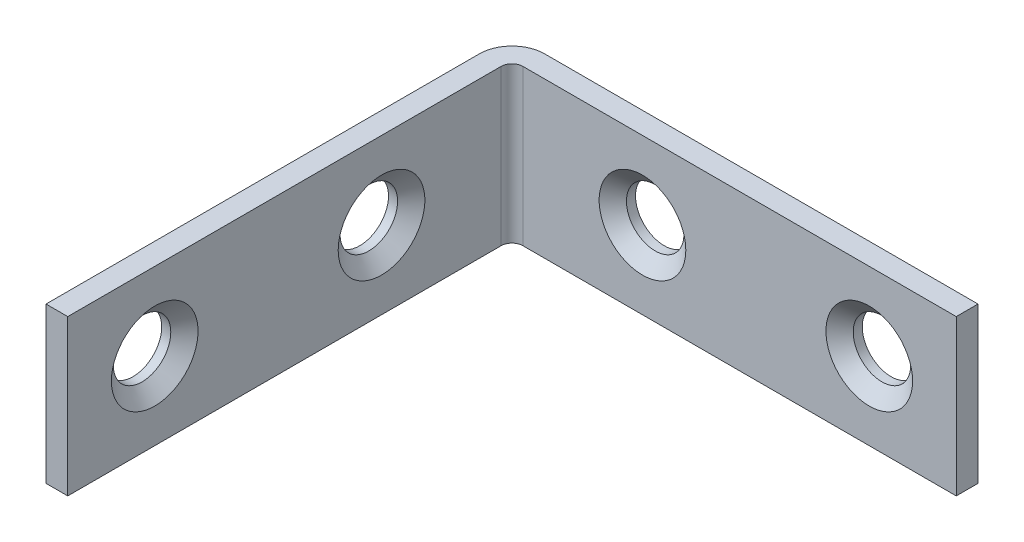
ISO-10303-21;
HEADER;
FILE_DESCRIPTION(('STEP AP214'),'2;1');
FILE_NAME('part.step','',(''),(''),'','','');
FILE_SCHEMA(('AUTOMOTIVE_DESIGN { 1 0 10303 214 1 1 1 1 }'));
ENDSEC;
DATA;
#1=APPLICATION_CONTEXT('core data for automotive mechanical design processes');
#2=APPLICATION_PROTOCOL_DEFINITION('international standard','automotive_design',2000,#1);
#3=PRODUCT_CONTEXT('',#1,'mechanical');
#4=PRODUCT('Part','Part','',(#3));
#5=PRODUCT_RELATED_PRODUCT_CATEGORY('part','',(#4));
#6=PRODUCT_DEFINITION_FORMATION('','',#4);
#7=PRODUCT_DEFINITION_CONTEXT('part definition',#1,'design');
#8=PRODUCT_DEFINITION('design','',#6,#7);
#9=PRODUCT_DEFINITION_SHAPE('','',#8);
#10=(LENGTH_UNIT() NAMED_UNIT(*) SI_UNIT(.MILLI.,.METRE.));
#11=(NAMED_UNIT(*) PLANE_ANGLE_UNIT() SI_UNIT($,.RADIAN.));
#12=(NAMED_UNIT(*) SI_UNIT($,.STERADIAN.) SOLID_ANGLE_UNIT());
#13=UNCERTAINTY_MEASURE_WITH_UNIT(LENGTH_MEASURE(1.E-05),#10,'distance_accuracy_value','');
#14=(GEOMETRIC_REPRESENTATION_CONTEXT(3) GLOBAL_UNCERTAINTY_ASSIGNED_CONTEXT((#13)) GLOBAL_UNIT_ASSIGNED_CONTEXT((#10,
#11,#12)) REPRESENTATION_CONTEXT('',''));
#15=CARTESIAN_POINT('',(0.,0.,0.));
#16=DIRECTION('',(0.,0.,1.));
#17=DIRECTION('',(1.,0.,0.));
#18=AXIS2_PLACEMENT_3D('',#15,#16,#17);
#19=CARTESIAN_POINT('',(2.667,6.35,1.778));
#20=DIRECTION('',(0.,0.,-1.));
#21=DIRECTION('',(-1.,0.,0.));
#22=AXIS2_PLACEMENT_3D('',#19,#20,#21);
#23=PLANE('',#22);
#24=CARTESIAN_POINT('',(12.446,0.,1.778));
#25=DIRECTION('',(0.,0.,1.));
#26=DIRECTION('',(1.,0.,0.));
#27=AXIS2_PLACEMENT_3D('',#24,#25,#26);
#28=CIRCLE('',#27,3.5433);
#29=CARTESIAN_POINT('',(15.9893,0.,1.778));
#30=VERTEX_POINT('',#29);
#31=EDGE_CURVE('E303',#30,#30,#28,.T.);
#32=ORIENTED_EDGE('',*,*,#31,.F.);
#33=EDGE_LOOP('',(#32));
#34=FACE_BOUND('',#33,.T.);
#35=CARTESIAN_POINT('',(30.988,0.,1.778));
#36=DIRECTION('',(0.,0.,1.));
#37=DIRECTION('',(1.,0.,0.));
#38=AXIS2_PLACEMENT_3D('',#35,#36,#37);
#39=CIRCLE('',#38,3.5433);
#40=CARTESIAN_POINT('',(34.5313,0.,1.778));
#41=VERTEX_POINT('',#40);
#42=EDGE_CURVE('E300',#41,#41,#39,.T.);
#43=ORIENTED_EDGE('',*,*,#42,.F.);
#44=EDGE_LOOP('',(#43));
#45=FACE_BOUND('',#44,.T.);
#46=DIRECTION('',(1.,0.,0.));
#47=VECTOR('',#46,1.);
#48=CARTESIAN_POINT('',(2.667,-6.35,1.778));
#49=LINE('',#48,#47);
#50=CARTESIAN_POINT('',(2.667,-6.35,1.778));
#51=VERTEX_POINT('',#50);
#52=CARTESIAN_POINT('',(38.1,-6.35,1.778));
#53=VERTEX_POINT('',#52);
#54=EDGE_CURVE('E269',#51,#53,#49,.T.);
#55=ORIENTED_EDGE('',*,*,#54,.T.);
#56=DIRECTION('',(0.,-1.,0.));
#57=VECTOR('',#56,1.);
#58=CARTESIAN_POINT('',(38.1,6.35,1.778));
#59=LINE('',#58,#57);
#60=CARTESIAN_POINT('',(38.1,6.35,1.778));
#61=VERTEX_POINT('',#60);
#62=EDGE_CURVE('E12',#61,#53,#59,.T.);
#63=ORIENTED_EDGE('',*,*,#62,.F.);
#64=DIRECTION('',(1.,0.,0.));
#65=VECTOR('',#64,1.);
#66=CARTESIAN_POINT('',(2.667,6.35,1.778));
#67=LINE('',#66,#65);
#68=CARTESIAN_POINT('',(2.667,6.35,1.778));
#69=VERTEX_POINT('',#68);
#70=EDGE_CURVE('E227',#69,#61,#67,.T.);
#71=ORIENTED_EDGE('',*,*,#70,.F.);
#72=DIRECTION('',(0.,-1.,0.));
#73=VECTOR('',#72,1.);
#74=CARTESIAN_POINT('',(2.667,6.35,1.778));
#75=LINE('',#74,#73);
#76=EDGE_CURVE('E268',#69,#51,#75,.T.);
#77=ORIENTED_EDGE('',*,*,#76,.T.);
#78=EDGE_LOOP('',(#55,#63,#71,#77));
#79=FACE_BOUND('',#78,.T.);
#80=ADVANCED_FACE('F170',(#34,#45,#79),#23,.F.);
#81=CARTESIAN_POINT('',(38.1,6.35,0.));
#82=DIRECTION('',(1.,0.,0.));
#83=DIRECTION('',(0.,0.,-1.));
#84=AXIS2_PLACEMENT_3D('',#81,#82,#83);
#85=PLANE('',#84);
#86=DIRECTION('',(0.,0.,1.));
#87=VECTOR('',#86,1.);
#88=CARTESIAN_POINT('',(38.1,-6.35,0.));
#89=LINE('',#88,#87);
#90=CARTESIAN_POINT('',(38.1,-6.35,0.));
#91=VERTEX_POINT('',#90);
#92=EDGE_CURVE('E272',#91,#53,#89,.T.);
#93=ORIENTED_EDGE('',*,*,#92,.F.);
#94=DIRECTION('',(0.,-1.,0.));
#95=VECTOR('',#94,1.);
#96=CARTESIAN_POINT('',(38.1,6.35,0.));
#97=LINE('',#96,#95);
#98=CARTESIAN_POINT('',(38.1,6.35,0.));
#99=VERTEX_POINT('',#98);
#100=EDGE_CURVE('E179',#99,#91,#97,.T.);
#101=ORIENTED_EDGE('',*,*,#100,.F.);
#102=DIRECTION('',(0.,0.,1.));
#103=VECTOR('',#102,1.);
#104=CARTESIAN_POINT('',(38.1,6.35,0.));
#105=LINE('',#104,#103);
#106=EDGE_CURVE('E332',#99,#61,#105,.T.);
#107=ORIENTED_EDGE('',*,*,#106,.T.);
#108=ORIENTED_EDGE('',*,*,#62,.T.);
#109=EDGE_LOOP('',(#93,#101,#107,#108));
#110=FACE_BOUND('',#109,.T.);
#111=ADVANCED_FACE('F364',(#110),#85,.T.);
#112=CARTESIAN_POINT('',(2.667,6.35,0.));
#113=DIRECTION('',(0.,0.,-1.));
#114=DIRECTION('',(-1.,0.,0.));
#115=AXIS2_PLACEMENT_3D('',#112,#113,#114);
#116=PLANE('',#115);
#117=CARTESIAN_POINT('',(12.446,0.,0.));
#118=DIRECTION('',(0.,0.,1.));
#119=DIRECTION('',(1.,0.,0.));
#120=AXIS2_PLACEMENT_3D('',#117,#118,#119);
#121=CIRCLE('',#120,2.3495);
#122=CARTESIAN_POINT('',(14.7955,0.,0.));
#123=VERTEX_POINT('',#122);
#124=EDGE_CURVE('E299',#123,#123,#121,.T.);
#125=ORIENTED_EDGE('',*,*,#124,.T.);
#126=EDGE_LOOP('',(#125));
#127=FACE_BOUND('',#126,.T.);
#128=CARTESIAN_POINT('',(30.988,0.,0.));
#129=DIRECTION('',(0.,0.,1.));
#130=DIRECTION('',(1.,0.,0.));
#131=AXIS2_PLACEMENT_3D('',#128,#129,#130);
#132=CIRCLE('',#131,2.34950000000001);
#133=CARTESIAN_POINT('',(33.3375,0.,0.));
#134=VERTEX_POINT('',#133);
#135=EDGE_CURVE('E273',#134,#134,#132,.T.);
#136=ORIENTED_EDGE('',*,*,#135,.T.);
#137=EDGE_LOOP('',(#136));
#138=FACE_BOUND('',#137,.T.);
#139=DIRECTION('',(1.,0.,0.));
#140=VECTOR('',#139,1.);
#141=CARTESIAN_POINT('',(2.667,-6.35,0.));
#142=LINE('',#141,#140);
#143=CARTESIAN_POINT('',(2.667,-6.35,0.));
#144=VERTEX_POINT('',#143);
#145=EDGE_CURVE('E276',#144,#91,#142,.T.);
#146=ORIENTED_EDGE('',*,*,#145,.F.);
#147=DIRECTION('',(0.,-1.,0.));
#148=VECTOR('',#147,1.);
#149=CARTESIAN_POINT('',(2.667,6.35,0.));
#150=LINE('',#149,#148);
#151=CARTESIAN_POINT('',(2.667,6.35,0.));
#152=VERTEX_POINT('',#151);
#153=EDGE_CURVE('E293',#152,#144,#150,.T.);
#154=ORIENTED_EDGE('',*,*,#153,.F.);
#155=DIRECTION('',(1.,0.,0.));
#156=VECTOR('',#155,1.);
#157=CARTESIAN_POINT('',(2.667,6.35,0.));
#158=LINE('',#157,#156);
#159=EDGE_CURVE('E335',#152,#99,#158,.T.);
#160=ORIENTED_EDGE('',*,*,#159,.T.);
#161=ORIENTED_EDGE('',*,*,#100,.T.);
#162=EDGE_LOOP('',(#146,#154,#160,#161));
#163=FACE_BOUND('',#162,.T.);
#164=ADVANCED_FACE('F371',(#127,#138,#163),#116,.T.);
#165=CARTESIAN_POINT('',(2.667,6.35,2.667));
#166=DIRECTION('',(0.,-1.,0.));
#167=DIRECTION('',(0.,0.,-1.));
#168=AXIS2_PLACEMENT_3D('',#165,#166,#167);
#169=CYLINDRICAL_SURFACE('',#168,2.667);
#170=CARTESIAN_POINT('',(2.667,-6.35,2.667));
#171=DIRECTION('',(0.,-1.,0.));
#172=DIRECTION('',(0.,0.,1.));
#173=AXIS2_PLACEMENT_3D('',#170,#171,#172);
#174=CIRCLE('',#173,2.667);
#175=CARTESIAN_POINT('',(0.,-6.35,2.667));
#176=VERTEX_POINT('',#175);
#177=EDGE_CURVE('E279',#176,#144,#174,.T.);
#178=ORIENTED_EDGE('',*,*,#177,.F.);
#179=DIRECTION('',(0.,-1.,0.));
#180=VECTOR('',#179,1.);
#181=CARTESIAN_POINT('',(0.,6.35,2.667));
#182=LINE('',#181,#180);
#183=CARTESIAN_POINT('',(0.,6.35,2.667));
#184=VERTEX_POINT('',#183);
#185=EDGE_CURVE('E291',#184,#176,#182,.T.);
#186=ORIENTED_EDGE('',*,*,#185,.F.);
#187=CARTESIAN_POINT('',(2.667,6.35,2.667));
#188=DIRECTION('',(0.,-1.,0.));
#189=DIRECTION('',(0.,0.,1.));
#190=AXIS2_PLACEMENT_3D('',#187,#188,#189);
#191=CIRCLE('',#190,2.667);
#192=EDGE_CURVE('E263',#184,#152,#191,.T.);
#193=ORIENTED_EDGE('',*,*,#192,.T.);
#194=ORIENTED_EDGE('',*,*,#153,.T.);
#195=EDGE_LOOP('',(#178,#186,#193,#194));
#196=FACE_BOUND('',#195,.T.);
#197=ADVANCED_FACE('F340',(#196),#169,.T.);
#198=CARTESIAN_POINT('',(0.,6.35,38.1));
#199=DIRECTION('',(-1.,0.,0.));
#200=DIRECTION('',(0.,0.,1.));
#201=AXIS2_PLACEMENT_3D('',#198,#199,#200);
#202=PLANE('',#201);
#203=CARTESIAN_POINT('',(0.,0.,12.446));
#204=DIRECTION('',(1.,0.,0.));
#205=DIRECTION('',(0.,0.,1.));
#206=AXIS2_PLACEMENT_3D('',#203,#204,#205);
#207=CIRCLE('',#206,2.3495);
#208=CARTESIAN_POINT('',(0.,0.,14.7955));
#209=VERTEX_POINT('',#208);
#210=EDGE_CURVE('E306',#209,#209,#207,.T.);
#211=ORIENTED_EDGE('',*,*,#210,.T.);
#212=EDGE_LOOP('',(#211));
#213=FACE_BOUND('',#212,.T.);
#214=CARTESIAN_POINT('',(-1.1145598333151E-13,0.,30.988));
#215=DIRECTION('',(1.,0.,0.));
#216=DIRECTION('',(0.,0.,1.));
#217=AXIS2_PLACEMENT_3D('',#214,#215,#216);
#218=CIRCLE('',#217,2.34950000000001);
#219=CARTESIAN_POINT('',(-1.18498849621673E-13,0.,33.3375));
#220=VERTEX_POINT('',#219);
#221=EDGE_CURVE('E311',#220,#220,#218,.T.);
#222=ORIENTED_EDGE('',*,*,#221,.T.);
#223=EDGE_LOOP('',(#222));
#224=FACE_BOUND('',#223,.T.);
#225=DIRECTION('',(0.,0.,-1.));
#226=VECTOR('',#225,1.);
#227=CARTESIAN_POINT('',(0.,-6.35,38.1));
#228=LINE('',#227,#226);
#229=CARTESIAN_POINT('',(0.,-6.35,38.1));
#230=VERTEX_POINT('',#229);
#231=EDGE_CURVE('E282',#230,#176,#228,.T.);
#232=ORIENTED_EDGE('',*,*,#231,.F.);
#233=DIRECTION('',(0.,-1.,0.));
#234=VECTOR('',#233,1.);
#235=CARTESIAN_POINT('',(0.,6.35,38.1));
#236=LINE('',#235,#234);
#237=CARTESIAN_POINT('',(0.,6.35,38.1));
#238=VERTEX_POINT('',#237);
#239=EDGE_CURVE('E251',#238,#230,#236,.T.);
#240=ORIENTED_EDGE('',*,*,#239,.F.);
#241=DIRECTION('',(0.,0.,-1.));
#242=VECTOR('',#241,1.);
#243=CARTESIAN_POINT('',(0.,6.35,38.1));
#244=LINE('',#243,#242);
#245=EDGE_CURVE('E261',#238,#184,#244,.T.);
#246=ORIENTED_EDGE('',*,*,#245,.T.);
#247=ORIENTED_EDGE('',*,*,#185,.T.);
#248=EDGE_LOOP('',(#232,#240,#246,#247));
#249=FACE_BOUND('',#248,.T.);
#250=ADVANCED_FACE('F345',(#213,#224,#249),#202,.T.);
#251=CARTESIAN_POINT('',(1.778,6.35,38.1));
#252=DIRECTION('',(0.,0.,1.));
#253=DIRECTION('',(1.,0.,0.));
#254=AXIS2_PLACEMENT_3D('',#251,#252,#253);
#255=PLANE('',#254);
#256=DIRECTION('',(-1.,0.,0.));
#257=VECTOR('',#256,1.);
#258=CARTESIAN_POINT('',(1.778,-6.35,38.1));
#259=LINE('',#258,#257);
#260=CARTESIAN_POINT('',(1.778,-6.35,38.1));
#261=VERTEX_POINT('',#260);
#262=EDGE_CURVE('E250',#261,#230,#259,.T.);
#263=ORIENTED_EDGE('',*,*,#262,.F.);
#264=DIRECTION('',(0.,-1.,0.));
#265=VECTOR('',#264,1.);
#266=CARTESIAN_POINT('',(1.778,6.35,38.1));
#267=LINE('',#266,#265);
#268=CARTESIAN_POINT('',(1.778,6.35,38.1));
#269=VERTEX_POINT('',#268);
#270=EDGE_CURVE('E244',#269,#261,#267,.T.);
#271=ORIENTED_EDGE('',*,*,#270,.F.);
#272=DIRECTION('',(-1.,0.,0.));
#273=VECTOR('',#272,1.);
#274=CARTESIAN_POINT('',(1.778,6.35,38.1));
#275=LINE('',#274,#273);
#276=EDGE_CURVE('E248',#269,#238,#275,.T.);
#277=ORIENTED_EDGE('',*,*,#276,.T.);
#278=ORIENTED_EDGE('',*,*,#239,.T.);
#279=EDGE_LOOP('',(#263,#271,#277,#278));
#280=FACE_BOUND('',#279,.T.);
#281=ADVANCED_FACE('F246',(#280),#255,.T.);
#282=CARTESIAN_POINT('',(1.778,6.35,38.1));
#283=DIRECTION('',(-1.,0.,0.));
#284=DIRECTION('',(0.,0.,1.));
#285=AXIS2_PLACEMENT_3D('',#282,#283,#284);
#286=PLANE('',#285);
#287=CARTESIAN_POINT('',(1.77799999999996,0.,12.446));
#288=DIRECTION('',(1.,0.,0.));
#289=DIRECTION('',(0.,0.,1.));
#290=AXIS2_PLACEMENT_3D('',#287,#288,#289);
#291=CIRCLE('',#290,3.5433);
#292=CARTESIAN_POINT('',(1.77799999999995,0.,15.9893));
#293=VERTEX_POINT('',#292);
#294=EDGE_CURVE('E318',#293,#293,#291,.T.);
#295=ORIENTED_EDGE('',*,*,#294,.F.);
#296=EDGE_LOOP('',(#295));
#297=FACE_BOUND('',#296,.T.);
#298=CARTESIAN_POINT('',(1.77799999999991,0.,30.988));
#299=DIRECTION('',(1.,0.,0.));
#300=DIRECTION('',(0.,0.,1.));
#301=AXIS2_PLACEMENT_3D('',#298,#299,#300);
#302=CIRCLE('',#301,3.5433);
#303=CARTESIAN_POINT('',(1.7779999999999,0.,34.5313));
#304=VERTEX_POINT('',#303);
#305=EDGE_CURVE('E307',#304,#304,#302,.T.);
#306=ORIENTED_EDGE('',*,*,#305,.F.);
#307=EDGE_LOOP('',(#306));
#308=FACE_BOUND('',#307,.T.);
#309=DIRECTION('',(0.,0.,-1.));
#310=VECTOR('',#309,1.);
#311=CARTESIAN_POINT('',(1.778,-6.35,38.1));
#312=LINE('',#311,#310);
#313=CARTESIAN_POINT('',(1.778,-6.35,2.667));
#314=VERTEX_POINT('',#313);
#315=EDGE_CURVE('E215',#261,#314,#312,.T.);
#316=ORIENTED_EDGE('',*,*,#315,.T.);
#317=DIRECTION('',(0.,-1.,0.));
#318=VECTOR('',#317,1.);
#319=CARTESIAN_POINT('',(1.778,6.35,2.667));
#320=LINE('',#319,#318);
#321=CARTESIAN_POINT('',(1.778,6.35,2.667));
#322=VERTEX_POINT('',#321);
#323=EDGE_CURVE('E252',#322,#314,#320,.T.);
#324=ORIENTED_EDGE('',*,*,#323,.F.);
#325=DIRECTION('',(0.,0.,-1.));
#326=VECTOR('',#325,1.);
#327=CARTESIAN_POINT('',(1.778,6.35,38.1));
#328=LINE('',#327,#326);
#329=EDGE_CURVE('E254',#269,#322,#328,.T.);
#330=ORIENTED_EDGE('',*,*,#329,.F.);
#331=ORIENTED_EDGE('',*,*,#270,.T.);
#332=EDGE_LOOP('',(#316,#324,#330,#331));
#333=FACE_BOUND('',#332,.T.);
#334=ADVANCED_FACE('F255',(#297,#308,#333),#286,.F.);
#335=CARTESIAN_POINT('',(2.667,6.35,2.667));
#336=DIRECTION('',(0.,-1.,0.));
#337=DIRECTION('',(0.,0.,-1.));
#338=AXIS2_PLACEMENT_3D('',#335,#336,#337);
#339=CYLINDRICAL_SURFACE('',#338,0.889);
#340=CARTESIAN_POINT('',(2.667,-6.35,2.667));
#341=DIRECTION('',(0.,1.,0.));
#342=DIRECTION('',(1.,0.,0.));
#343=AXIS2_PLACEMENT_3D('',#340,#341,#342);
#344=CIRCLE('',#343,0.889);
#345=EDGE_CURVE('E221',#314,#51,#344,.F.);
#346=ORIENTED_EDGE('',*,*,#345,.T.);
#347=ORIENTED_EDGE('',*,*,#76,.F.);
#348=CARTESIAN_POINT('',(2.667,6.35,2.667));
#349=DIRECTION('',(0.,1.,0.));
#350=DIRECTION('',(1.,0.,0.));
#351=AXIS2_PLACEMENT_3D('',#348,#349,#350);
#352=CIRCLE('',#351,0.889);
#353=EDGE_CURVE('E188',#322,#69,#352,.F.);
#354=ORIENTED_EDGE('',*,*,#353,.F.);
#355=ORIENTED_EDGE('',*,*,#323,.T.);
#356=EDGE_LOOP('',(#346,#347,#354,#355));
#357=FACE_BOUND('',#356,.T.);
#358=ADVANCED_FACE('F351',(#357),#339,.F.);
#359=CARTESIAN_POINT('',(2.667,6.35,2.667));
#360=DIRECTION('',(0.,-1.,0.));
#361=DIRECTION('',(-1.,0.,0.));
#362=AXIS2_PLACEMENT_3D('',#359,#360,#361);
#363=PLANE('',#362);
#364=ORIENTED_EDGE('',*,*,#70,.T.);
#365=ORIENTED_EDGE('',*,*,#106,.F.);
#366=ORIENTED_EDGE('',*,*,#159,.F.);
#367=ORIENTED_EDGE('',*,*,#192,.F.);
#368=ORIENTED_EDGE('',*,*,#245,.F.);
#369=ORIENTED_EDGE('',*,*,#276,.F.);
#370=ORIENTED_EDGE('',*,*,#329,.T.);
#371=ORIENTED_EDGE('',*,*,#353,.T.);
#372=EDGE_LOOP('',(#364,#365,#366,#367,#368,#369,#370,#371));
#373=FACE_BOUND('',#372,.T.);
#374=ADVANCED_FACE('F258',(#373),#363,.F.);
#375=CARTESIAN_POINT('',(2.667,-6.35,2.667));
#376=DIRECTION('',(0.,-1.,0.));
#377=DIRECTION('',(-1.,0.,0.));
#378=AXIS2_PLACEMENT_3D('',#375,#376,#377);
#379=PLANE('',#378);
#380=ORIENTED_EDGE('',*,*,#54,.F.);
#381=ORIENTED_EDGE('',*,*,#345,.F.);
#382=ORIENTED_EDGE('',*,*,#315,.F.);
#383=ORIENTED_EDGE('',*,*,#262,.T.);
#384=ORIENTED_EDGE('',*,*,#231,.T.);
#385=ORIENTED_EDGE('',*,*,#177,.T.);
#386=ORIENTED_EDGE('',*,*,#145,.T.);
#387=ORIENTED_EDGE('',*,*,#92,.T.);
#388=EDGE_LOOP('',(#380,#381,#382,#383,#384,#385,#386,#387));
#389=FACE_BOUND('',#388,.T.);
#390=ADVANCED_FACE('F348',(#389),#379,.T.);
#391=CARTESIAN_POINT('',(30.988,0.,0.));
#392=DIRECTION('',(0.,0.,1.));
#393=DIRECTION('',(1.,0.,0.));
#394=AXIS2_PLACEMENT_3D('',#391,#392,#393);
#395=CYLINDRICAL_SURFACE('',#394,2.34950000000001);
#396=CARTESIAN_POINT('',(30.988,0.,0.740245492394996));
#397=DIRECTION('',(0.,0.,1.));
#398=DIRECTION('',(1.,0.,0.));
#399=AXIS2_PLACEMENT_3D('',#396,#397,#398);
#400=CIRCLE('',#399,2.34950000000001);
#401=CARTESIAN_POINT('',(33.3375,0.,0.740245492394996));
#402=VERTEX_POINT('',#401);
#403=EDGE_CURVE('E296',#402,#402,#400,.T.);
#404=ORIENTED_EDGE('',*,*,#403,.T.);
#405=EDGE_LOOP('',(#404));
#406=FACE_BOUND('',#405,.T.);
#407=ORIENTED_EDGE('',*,*,#135,.F.);
#408=EDGE_LOOP('',(#407));
#409=FACE_BOUND('',#408,.T.);
#410=ADVANCED_FACE('F385',(#406,#409),#395,.F.);
#411=CARTESIAN_POINT('',(12.446,0.,0.));
#412=DIRECTION('',(0.,0.,1.));
#413=DIRECTION('',(1.,0.,0.));
#414=AXIS2_PLACEMENT_3D('',#411,#412,#413);
#415=CYLINDRICAL_SURFACE('',#414,2.3495);
#416=CARTESIAN_POINT('',(12.446,0.,0.740245492394996));
#417=DIRECTION('',(0.,0.,1.));
#418=DIRECTION('',(1.,0.,0.));
#419=AXIS2_PLACEMENT_3D('',#416,#417,#418);
#420=CIRCLE('',#419,2.3495);
#421=CARTESIAN_POINT('',(14.7955,0.,0.740245492394996));
#422=VERTEX_POINT('',#421);
#423=EDGE_CURVE('E301',#422,#422,#420,.T.);
#424=ORIENTED_EDGE('',*,*,#423,.T.);
#425=EDGE_LOOP('',(#424));
#426=FACE_BOUND('',#425,.T.);
#427=ORIENTED_EDGE('',*,*,#124,.F.);
#428=EDGE_LOOP('',(#427));
#429=FACE_BOUND('',#428,.T.);
#430=ADVANCED_FACE('F381',(#426,#429),#415,.F.);
#431=CARTESIAN_POINT('',(30.988,0.,1.778));
#432=DIRECTION('',(0.,0.,1.));
#433=DIRECTION('',(1.,0.,0.));
#434=AXIS2_PLACEMENT_3D('',#431,#432,#433);
#435=CONICAL_SURFACE('',#434,3.5433,0.855211333477223);
#436=ORIENTED_EDGE('',*,*,#42,.T.);
#437=EDGE_LOOP('',(#436));
#438=FACE_BOUND('',#437,.T.);
#439=ORIENTED_EDGE('',*,*,#403,.F.);
#440=EDGE_LOOP('',(#439));
#441=FACE_BOUND('',#440,.T.);
#442=ADVANCED_FACE('F377',(#438,#441),#435,.F.);
#443=CARTESIAN_POINT('',(12.446,0.,1.778));
#444=DIRECTION('',(0.,0.,1.));
#445=DIRECTION('',(1.,0.,0.));
#446=AXIS2_PLACEMENT_3D('',#443,#444,#445);
#447=CONICAL_SURFACE('',#446,3.5433,0.855211333477223);
#448=ORIENTED_EDGE('',*,*,#31,.T.);
#449=EDGE_LOOP('',(#448));
#450=FACE_BOUND('',#449,.T.);
#451=ORIENTED_EDGE('',*,*,#423,.F.);
#452=EDGE_LOOP('',(#451));
#453=FACE_BOUND('',#452,.T.);
#454=ADVANCED_FACE('F380',(#450,#453),#447,.F.);
#455=CARTESIAN_POINT('',(-1.1145598333151E-13,0.,30.988));
#456=DIRECTION('',(1.,0.,0.));
#457=DIRECTION('',(0.,0.,-1.));
#458=AXIS2_PLACEMENT_3D('',#455,#456,#457);
#459=CYLINDRICAL_SURFACE('',#458,2.34950000000001);
#460=CARTESIAN_POINT('',(0.740245492394903,0.,30.988));
#461=DIRECTION('',(1.,0.,0.));
#462=DIRECTION('',(0.,0.,-1.));
#463=AXIS2_PLACEMENT_3D('',#460,#461,#462);
#464=CIRCLE('',#463,2.34950000000001);
#465=CARTESIAN_POINT('',(0.740245492394911,0.,28.6385));
#466=VERTEX_POINT('',#465);
#467=EDGE_CURVE('E304',#466,#466,#464,.T.);
#468=ORIENTED_EDGE('',*,*,#467,.T.);
#469=EDGE_LOOP('',(#468));
#470=FACE_BOUND('',#469,.T.);
#471=ORIENTED_EDGE('',*,*,#221,.F.);
#472=EDGE_LOOP('',(#471));
#473=FACE_BOUND('',#472,.T.);
#474=ADVANCED_FACE('F430',(#470,#473),#459,.F.);
#475=CARTESIAN_POINT('',(0.,0.,12.446));
#476=DIRECTION('',(1.,0.,0.));
#477=DIRECTION('',(0.,0.,-1.));
#478=AXIS2_PLACEMENT_3D('',#475,#476,#477);
#479=CYLINDRICAL_SURFACE('',#478,2.3495);
#480=CARTESIAN_POINT('',(0.740245492394959,0.,12.446));
#481=DIRECTION('',(1.,0.,0.));
#482=DIRECTION('',(0.,0.,-1.));
#483=AXIS2_PLACEMENT_3D('',#480,#481,#482);
#484=CIRCLE('',#483,2.3495);
#485=CARTESIAN_POINT('',(0.740245492394967,0.,10.0965));
#486=VERTEX_POINT('',#485);
#487=EDGE_CURVE('E173',#486,#486,#484,.T.);
#488=ORIENTED_EDGE('',*,*,#487,.T.);
#489=EDGE_LOOP('',(#488));
#490=FACE_BOUND('',#489,.T.);
#491=ORIENTED_EDGE('',*,*,#210,.F.);
#492=EDGE_LOOP('',(#491));
#493=FACE_BOUND('',#492,.T.);
#494=ADVANCED_FACE('F434',(#490,#493),#479,.F.);
#495=CARTESIAN_POINT('',(1.77799999999991,0.,30.988));
#496=DIRECTION('',(1.,0.,0.));
#497=DIRECTION('',(0.,0.,1.));
#498=AXIS2_PLACEMENT_3D('',#495,#496,#497);
#499=CONICAL_SURFACE('',#498,3.5433,0.855211333477223);
#500=ORIENTED_EDGE('',*,*,#305,.T.);
#501=EDGE_LOOP('',(#500));
#502=FACE_BOUND('',#501,.T.);
#503=ORIENTED_EDGE('',*,*,#467,.F.);
#504=EDGE_LOOP('',(#503));
#505=FACE_BOUND('',#504,.T.);
#506=ADVANCED_FACE('F441',(#502,#505),#499,.F.);
#507=CARTESIAN_POINT('',(1.77799999999996,0.,12.446));
#508=DIRECTION('',(1.,0.,0.));
#509=DIRECTION('',(0.,0.,1.));
#510=AXIS2_PLACEMENT_3D('',#507,#508,#509);
#511=CONICAL_SURFACE('',#510,3.5433,0.855211333477223);
#512=ORIENTED_EDGE('',*,*,#294,.T.);
#513=EDGE_LOOP('',(#512));
#514=FACE_BOUND('',#513,.T.);
#515=ORIENTED_EDGE('',*,*,#487,.F.);
#516=EDGE_LOOP('',(#515));
#517=FACE_BOUND('',#516,.T.);
#518=ADVANCED_FACE('F449',(#514,#517),#511,.F.);
#519=CLOSED_SHELL('',(#80,#111,#164,#197,#250,#281,#334,#358,#374,#390,#410,#430,#442,#454,#474,
#494,#506,#518));
#520=MANIFOLD_SOLID_BREP('B2',#519);
#521=ADVANCED_BREP_SHAPE_REPRESENTATION('',(#18,#520),#14);
#522=SHAPE_DEFINITION_REPRESENTATION(#9,#521);
ENDSEC;
END-ISO-10303-21;
